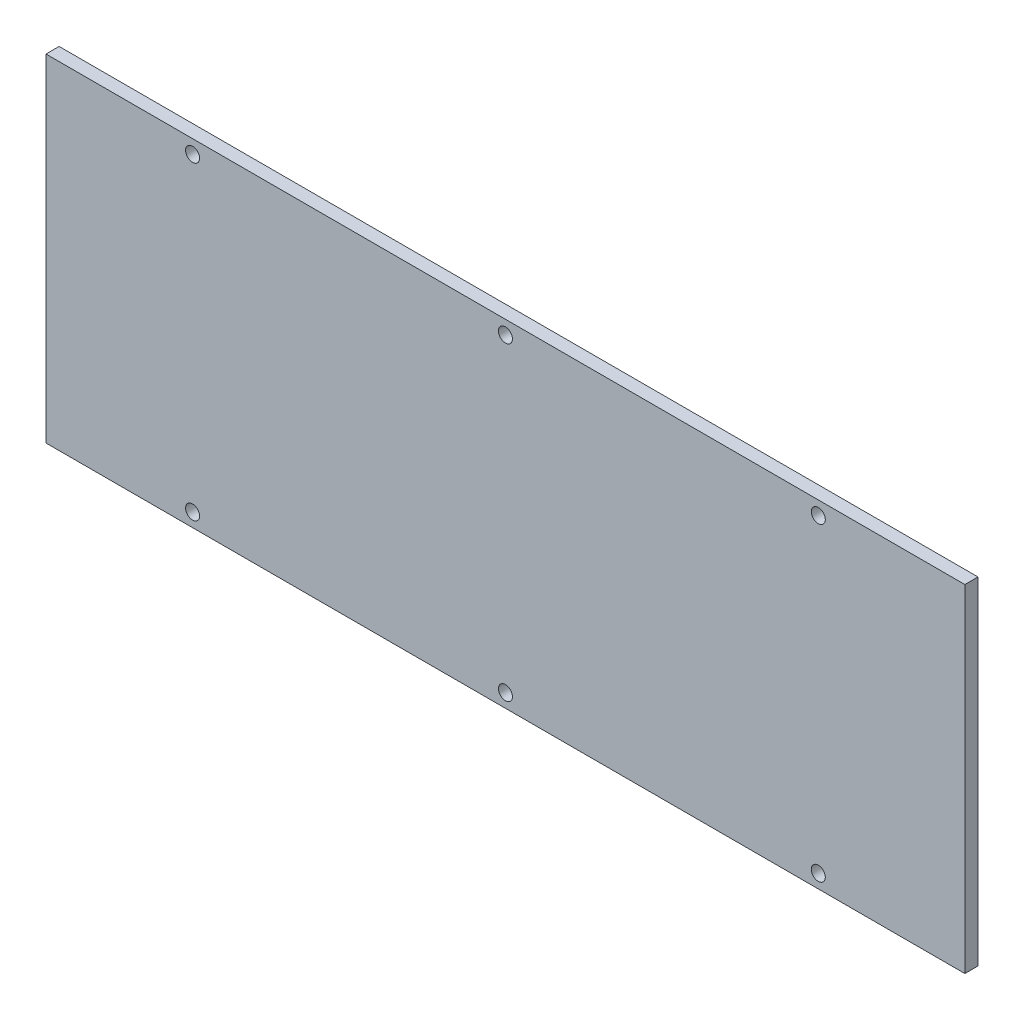
ISO-10303-21;
HEADER;
FILE_DESCRIPTION(('STEP AP214'),'2;1');
FILE_NAME('part.step','',(''),(''),'','','');
FILE_SCHEMA(('AUTOMOTIVE_DESIGN { 1 0 10303 214 1 1 1 1 }'));
ENDSEC;
DATA;
#1=APPLICATION_CONTEXT('core data for automotive mechanical design processes');
#2=APPLICATION_PROTOCOL_DEFINITION('international standard','automotive_design',2000,#1);
#3=PRODUCT_CONTEXT('',#1,'mechanical');
#4=PRODUCT('Part','Part','',(#3));
#5=PRODUCT_RELATED_PRODUCT_CATEGORY('part','',(#4));
#6=PRODUCT_DEFINITION_FORMATION('','',#4);
#7=PRODUCT_DEFINITION_CONTEXT('part definition',#1,'design');
#8=PRODUCT_DEFINITION('design','',#6,#7);
#9=PRODUCT_DEFINITION_SHAPE('','',#8);
#10=(LENGTH_UNIT() NAMED_UNIT(*) SI_UNIT(.MILLI.,.METRE.));
#11=(NAMED_UNIT(*) PLANE_ANGLE_UNIT() SI_UNIT($,.RADIAN.));
#12=(NAMED_UNIT(*) SI_UNIT($,.STERADIAN.) SOLID_ANGLE_UNIT());
#13=UNCERTAINTY_MEASURE_WITH_UNIT(LENGTH_MEASURE(1.E-05),#10,'distance_accuracy_value','');
#14=(GEOMETRIC_REPRESENTATION_CONTEXT(3) GLOBAL_UNCERTAINTY_ASSIGNED_CONTEXT((#13)) GLOBAL_UNIT_ASSIGNED_CONTEXT((#10,
#11,#12)) REPRESENTATION_CONTEXT('',''));
#15=CARTESIAN_POINT('',(0.,0.,0.));
#16=DIRECTION('',(0.,0.,1.));
#17=DIRECTION('',(1.,0.,0.));
#18=AXIS2_PLACEMENT_3D('',#15,#16,#17);
#19=CARTESIAN_POINT('',(-105.,38.5,3.));
#20=DIRECTION('',(0.,0.,1.));
#21=DIRECTION('',(1.,0.,0.));
#22=AXIS2_PLACEMENT_3D('',#19,#20,#21);
#23=PLANE('',#22);
#24=CARTESIAN_POINT('',(0.,-35.4,3.));
#25=DIRECTION('',(0.,0.,1.));
#26=DIRECTION('',(-1.,0.,0.));
#27=AXIS2_PLACEMENT_3D('',#24,#25,#26);
#28=CIRCLE('',#27,1.6);
#29=CARTESIAN_POINT('',(-1.6,-35.4,3.));
#30=VERTEX_POINT('',#29);
#31=EDGE_CURVE('E133',#30,#30,#28,.T.);
#32=ORIENTED_EDGE('',*,*,#31,.F.);
#33=EDGE_LOOP('',(#32));
#34=FACE_BOUND('',#33,.T.);
#35=CARTESIAN_POINT('',(71.5,35.4,3.));
#36=DIRECTION('',(0.,0.,1.));
#37=DIRECTION('',(1.,0.,0.));
#38=AXIS2_PLACEMENT_3D('',#35,#36,#37);
#39=CIRCLE('',#38,1.60000000000001);
#40=CARTESIAN_POINT('',(73.1,35.4,3.));
#41=VERTEX_POINT('',#40);
#42=EDGE_CURVE('E121',#41,#41,#39,.T.);
#43=ORIENTED_EDGE('',*,*,#42,.F.);
#44=EDGE_LOOP('',(#43));
#45=FACE_BOUND('',#44,.T.);
#46=CARTESIAN_POINT('',(0.,35.4,3.));
#47=DIRECTION('',(0.,0.,1.));
#48=DIRECTION('',(1.,0.,0.));
#49=AXIS2_PLACEMENT_3D('',#46,#47,#48);
#50=CIRCLE('',#49,1.6);
#51=CARTESIAN_POINT('',(1.6,35.4,3.));
#52=VERTEX_POINT('',#51);
#53=EDGE_CURVE('E100',#52,#52,#50,.T.);
#54=ORIENTED_EDGE('',*,*,#53,.F.);
#55=EDGE_LOOP('',(#54));
#56=FACE_BOUND('',#55,.T.);
#57=DIRECTION('',(0.,-1.,0.));
#58=VECTOR('',#57,1.);
#59=CARTESIAN_POINT('',(-105.,-38.5,3.));
#60=LINE('',#59,#58);
#61=CARTESIAN_POINT('',(-105.,38.5,3.));
#62=VERTEX_POINT('',#61);
#63=CARTESIAN_POINT('',(-105.,-38.5,3.));
#64=VERTEX_POINT('',#63);
#65=EDGE_CURVE('E85',#62,#64,#60,.T.);
#66=ORIENTED_EDGE('',*,*,#65,.T.);
#67=DIRECTION('',(1.,0.,0.));
#68=VECTOR('',#67,1.);
#69=CARTESIAN_POINT('',(105.,-38.5,3.));
#70=LINE('',#69,#68);
#71=CARTESIAN_POINT('',(105.,-38.5,3.));
#72=VERTEX_POINT('',#71);
#73=EDGE_CURVE('E80',#64,#72,#70,.T.);
#74=ORIENTED_EDGE('',*,*,#73,.T.);
#75=DIRECTION('',(0.,1.,0.));
#76=VECTOR('',#75,1.);
#77=CARTESIAN_POINT('',(105.,-38.5,3.));
#78=LINE('',#77,#76);
#79=CARTESIAN_POINT('',(105.,38.5,3.));
#80=VERTEX_POINT('',#79);
#81=EDGE_CURVE('E83',#72,#80,#78,.T.);
#82=ORIENTED_EDGE('',*,*,#81,.T.);
#83=DIRECTION('',(-1.,0.,0.));
#84=VECTOR('',#83,1.);
#85=CARTESIAN_POINT('',(105.,38.5,3.));
#86=LINE('',#85,#84);
#87=EDGE_CURVE('E50',#80,#62,#86,.T.);
#88=ORIENTED_EDGE('',*,*,#87,.T.);
#89=EDGE_LOOP('',(#66,#74,#82,#88));
#90=FACE_BOUND('',#89,.T.);
#91=CARTESIAN_POINT('',(-71.5,35.4,3.));
#92=DIRECTION('',(0.,0.,1.));
#93=DIRECTION('',(1.,0.,0.));
#94=AXIS2_PLACEMENT_3D('',#91,#92,#93);
#95=CIRCLE('',#94,1.60000000000001);
#96=CARTESIAN_POINT('',(-69.9,35.4,3.));
#97=VERTEX_POINT('',#96);
#98=EDGE_CURVE('E115',#97,#97,#95,.T.);
#99=ORIENTED_EDGE('',*,*,#98,.F.);
#100=EDGE_LOOP('',(#99));
#101=FACE_BOUND('',#100,.T.);
#102=CARTESIAN_POINT('',(71.5,-35.4,3.));
#103=DIRECTION('',(0.,0.,1.));
#104=DIRECTION('',(-1.,0.,0.));
#105=AXIS2_PLACEMENT_3D('',#102,#103,#104);
#106=CIRCLE('',#105,1.60000000000001);
#107=CARTESIAN_POINT('',(69.9,-35.4,3.));
#108=VERTEX_POINT('',#107);
#109=EDGE_CURVE('E127',#108,#108,#106,.T.);
#110=ORIENTED_EDGE('',*,*,#109,.F.);
#111=EDGE_LOOP('',(#110));
#112=FACE_BOUND('',#111,.T.);
#113=CARTESIAN_POINT('',(-71.5,-35.4,3.));
#114=DIRECTION('',(0.,0.,1.));
#115=DIRECTION('',(-1.,0.,0.));
#116=AXIS2_PLACEMENT_3D('',#113,#114,#115);
#117=CIRCLE('',#116,1.60000000000001);
#118=CARTESIAN_POINT('',(-73.1,-35.4,3.));
#119=VERTEX_POINT('',#118);
#120=EDGE_CURVE('E139',#119,#119,#117,.T.);
#121=ORIENTED_EDGE('',*,*,#120,.F.);
#122=EDGE_LOOP('',(#121));
#123=FACE_BOUND('',#122,.T.);
#124=ADVANCED_FACE('F33',(#34,#45,#56,#90,#101,#112,#123),#23,.T.);
#125=CARTESIAN_POINT('',(-105.,38.5,0.));
#126=DIRECTION('',(0.,0.,1.));
#127=DIRECTION('',(1.,0.,0.));
#128=AXIS2_PLACEMENT_3D('',#125,#126,#127);
#129=PLANE('',#128);
#130=CARTESIAN_POINT('',(0.,-35.4,0.));
#131=DIRECTION('',(0.,0.,1.));
#132=DIRECTION('',(-1.,0.,0.));
#133=AXIS2_PLACEMENT_3D('',#130,#131,#132);
#134=CIRCLE('',#133,1.6);
#135=CARTESIAN_POINT('',(-1.6,-35.4,0.));
#136=VERTEX_POINT('',#135);
#137=EDGE_CURVE('E136',#136,#136,#134,.T.);
#138=ORIENTED_EDGE('',*,*,#137,.T.);
#139=EDGE_LOOP('',(#138));
#140=FACE_BOUND('',#139,.T.);
#141=CARTESIAN_POINT('',(71.5,35.4,0.));
#142=DIRECTION('',(0.,0.,1.));
#143=DIRECTION('',(1.,0.,0.));
#144=AXIS2_PLACEMENT_3D('',#141,#142,#143);
#145=CIRCLE('',#144,1.60000000000001);
#146=CARTESIAN_POINT('',(73.1,35.4,0.));
#147=VERTEX_POINT('',#146);
#148=EDGE_CURVE('E124',#147,#147,#145,.T.);
#149=ORIENTED_EDGE('',*,*,#148,.T.);
#150=EDGE_LOOP('',(#149));
#151=FACE_BOUND('',#150,.T.);
#152=CARTESIAN_POINT('',(0.,35.4,0.));
#153=DIRECTION('',(0.,0.,1.));
#154=DIRECTION('',(1.,0.,0.));
#155=AXIS2_PLACEMENT_3D('',#152,#153,#154);
#156=CIRCLE('',#155,1.6);
#157=CARTESIAN_POINT('',(1.6,35.4,0.));
#158=VERTEX_POINT('',#157);
#159=EDGE_CURVE('E112',#158,#158,#156,.T.);
#160=ORIENTED_EDGE('',*,*,#159,.T.);
#161=EDGE_LOOP('',(#160));
#162=FACE_BOUND('',#161,.T.);
#163=DIRECTION('',(0.,-1.,0.));
#164=VECTOR('',#163,1.);
#165=CARTESIAN_POINT('',(-105.,-38.5,0.));
#166=LINE('',#165,#164);
#167=CARTESIAN_POINT('',(-105.,38.5,0.));
#168=VERTEX_POINT('',#167);
#169=CARTESIAN_POINT('',(-105.,-38.5,0.));
#170=VERTEX_POINT('',#169);
#171=EDGE_CURVE('E97',#168,#170,#166,.T.);
#172=ORIENTED_EDGE('',*,*,#171,.F.);
#173=DIRECTION('',(-1.,0.,0.));
#174=VECTOR('',#173,1.);
#175=CARTESIAN_POINT('',(105.,38.5,0.));
#176=LINE('',#175,#174);
#177=CARTESIAN_POINT('',(105.,38.5,0.));
#178=VERTEX_POINT('',#177);
#179=EDGE_CURVE('E73',#178,#168,#176,.T.);
#180=ORIENTED_EDGE('',*,*,#179,.F.);
#181=DIRECTION('',(0.,1.,0.));
#182=VECTOR('',#181,1.);
#183=CARTESIAN_POINT('',(105.,-38.5,0.));
#184=LINE('',#183,#182);
#185=CARTESIAN_POINT('',(105.,-38.5,0.));
#186=VERTEX_POINT('',#185);
#187=EDGE_CURVE('E67',#186,#178,#184,.T.);
#188=ORIENTED_EDGE('',*,*,#187,.F.);
#189=DIRECTION('',(1.,0.,0.));
#190=VECTOR('',#189,1.);
#191=CARTESIAN_POINT('',(105.,-38.5,0.));
#192=LINE('',#191,#190);
#193=EDGE_CURVE('E89',#170,#186,#192,.T.);
#194=ORIENTED_EDGE('',*,*,#193,.F.);
#195=EDGE_LOOP('',(#172,#180,#188,#194));
#196=FACE_BOUND('',#195,.T.);
#197=CARTESIAN_POINT('',(-71.5,35.4,0.));
#198=DIRECTION('',(0.,0.,1.));
#199=DIRECTION('',(1.,0.,0.));
#200=AXIS2_PLACEMENT_3D('',#197,#198,#199);
#201=CIRCLE('',#200,1.60000000000001);
#202=CARTESIAN_POINT('',(-69.9,35.4,0.));
#203=VERTEX_POINT('',#202);
#204=EDGE_CURVE('E118',#203,#203,#201,.T.);
#205=ORIENTED_EDGE('',*,*,#204,.T.);
#206=EDGE_LOOP('',(#205));
#207=FACE_BOUND('',#206,.T.);
#208=CARTESIAN_POINT('',(71.5,-35.4,0.));
#209=DIRECTION('',(0.,0.,1.));
#210=DIRECTION('',(-1.,0.,0.));
#211=AXIS2_PLACEMENT_3D('',#208,#209,#210);
#212=CIRCLE('',#211,1.60000000000001);
#213=CARTESIAN_POINT('',(69.9,-35.4,0.));
#214=VERTEX_POINT('',#213);
#215=EDGE_CURVE('E130',#214,#214,#212,.T.);
#216=ORIENTED_EDGE('',*,*,#215,.T.);
#217=EDGE_LOOP('',(#216));
#218=FACE_BOUND('',#217,.T.);
#219=CARTESIAN_POINT('',(-71.5,-35.4,0.));
#220=DIRECTION('',(0.,0.,1.));
#221=DIRECTION('',(-1.,0.,0.));
#222=AXIS2_PLACEMENT_3D('',#219,#220,#221);
#223=CIRCLE('',#222,1.60000000000001);
#224=CARTESIAN_POINT('',(-73.1,-35.4,0.));
#225=VERTEX_POINT('',#224);
#226=EDGE_CURVE('E142',#225,#225,#223,.T.);
#227=ORIENTED_EDGE('',*,*,#226,.T.);
#228=EDGE_LOOP('',(#227));
#229=FACE_BOUND('',#228,.T.);
#230=ADVANCED_FACE('F108',(#140,#151,#162,#196,#207,#218,#229),#129,.F.);
#231=CARTESIAN_POINT('',(-105.,-38.5,3.));
#232=DIRECTION('',(1.,0.,0.));
#233=DIRECTION('',(0.,0.,-1.));
#234=AXIS2_PLACEMENT_3D('',#231,#232,#233);
#235=PLANE('',#234);
#236=ORIENTED_EDGE('',*,*,#171,.T.);
#237=DIRECTION('',(0.,0.,-1.));
#238=VECTOR('',#237,1.);
#239=CARTESIAN_POINT('',(-105.,-38.5,3.));
#240=LINE('',#239,#238);
#241=EDGE_CURVE('E11',#64,#170,#240,.T.);
#242=ORIENTED_EDGE('',*,*,#241,.F.);
#243=ORIENTED_EDGE('',*,*,#65,.F.);
#244=DIRECTION('',(0.,0.,-1.));
#245=VECTOR('',#244,1.);
#246=CARTESIAN_POINT('',(-105.,38.5,3.));
#247=LINE('',#246,#245);
#248=EDGE_CURVE('E93',#62,#168,#247,.T.);
#249=ORIENTED_EDGE('',*,*,#248,.T.);
#250=EDGE_LOOP('',(#236,#242,#243,#249));
#251=FACE_BOUND('',#250,.T.);
#252=ADVANCED_FACE('F35',(#251),#235,.F.);
#253=CARTESIAN_POINT('',(105.,-38.5,3.));
#254=DIRECTION('',(0.,1.,0.));
#255=DIRECTION('',(-1.,0.,0.));
#256=AXIS2_PLACEMENT_3D('',#253,#254,#255);
#257=PLANE('',#256);
#258=ORIENTED_EDGE('',*,*,#193,.T.);
#259=DIRECTION('',(0.,0.,-1.));
#260=VECTOR('',#259,1.);
#261=CARTESIAN_POINT('',(105.,-38.5,3.));
#262=LINE('',#261,#260);
#263=EDGE_CURVE('E42',#72,#186,#262,.T.);
#264=ORIENTED_EDGE('',*,*,#263,.F.);
#265=ORIENTED_EDGE('',*,*,#73,.F.);
#266=ORIENTED_EDGE('',*,*,#241,.T.);
#267=EDGE_LOOP('',(#258,#264,#265,#266));
#268=FACE_BOUND('',#267,.T.);
#269=ADVANCED_FACE('F88',(#268),#257,.F.);
#270=CARTESIAN_POINT('',(105.,-38.5,3.));
#271=DIRECTION('',(-1.,0.,0.));
#272=DIRECTION('',(0.,0.,1.));
#273=AXIS2_PLACEMENT_3D('',#270,#271,#272);
#274=PLANE('',#273);
#275=ORIENTED_EDGE('',*,*,#187,.T.);
#276=DIRECTION('',(0.,0.,-1.));
#277=VECTOR('',#276,1.);
#278=CARTESIAN_POINT('',(105.,38.5,3.));
#279=LINE('',#278,#277);
#280=EDGE_CURVE('E90',#80,#178,#279,.T.);
#281=ORIENTED_EDGE('',*,*,#280,.F.);
#282=ORIENTED_EDGE('',*,*,#81,.F.);
#283=ORIENTED_EDGE('',*,*,#263,.T.);
#284=EDGE_LOOP('',(#275,#281,#282,#283));
#285=FACE_BOUND('',#284,.T.);
#286=ADVANCED_FACE('F91',(#285),#274,.F.);
#287=CARTESIAN_POINT('',(105.,38.5,3.));
#288=DIRECTION('',(0.,-1.,0.));
#289=DIRECTION('',(1.,0.,0.));
#290=AXIS2_PLACEMENT_3D('',#287,#288,#289);
#291=PLANE('',#290);
#292=ORIENTED_EDGE('',*,*,#179,.T.);
#293=ORIENTED_EDGE('',*,*,#248,.F.);
#294=ORIENTED_EDGE('',*,*,#87,.F.);
#295=ORIENTED_EDGE('',*,*,#280,.T.);
#296=EDGE_LOOP('',(#292,#293,#294,#295));
#297=FACE_BOUND('',#296,.T.);
#298=ADVANCED_FACE('F105',(#297),#291,.F.);
#299=CARTESIAN_POINT('',(0.,35.4,3.));
#300=DIRECTION('',(0.,0.,-1.));
#301=DIRECTION('',(-1.,0.,0.));
#302=AXIS2_PLACEMENT_3D('',#299,#300,#301);
#303=CYLINDRICAL_SURFACE('',#302,1.6);
#304=ORIENTED_EDGE('',*,*,#53,.T.);
#305=EDGE_LOOP('',(#304));
#306=FACE_BOUND('',#305,.T.);
#307=ORIENTED_EDGE('',*,*,#159,.F.);
#308=EDGE_LOOP('',(#307));
#309=FACE_BOUND('',#308,.T.);
#310=ADVANCED_FACE('F162',(#306,#309),#303,.F.);
#311=CARTESIAN_POINT('',(-71.5,35.4,3.));
#312=DIRECTION('',(0.,0.,-1.));
#313=DIRECTION('',(-1.,0.,0.));
#314=AXIS2_PLACEMENT_3D('',#311,#312,#313);
#315=CYLINDRICAL_SURFACE('',#314,1.60000000000001);
#316=ORIENTED_EDGE('',*,*,#98,.T.);
#317=EDGE_LOOP('',(#316));
#318=FACE_BOUND('',#317,.T.);
#319=ORIENTED_EDGE('',*,*,#204,.F.);
#320=EDGE_LOOP('',(#319));
#321=FACE_BOUND('',#320,.T.);
#322=ADVANCED_FACE('F208',(#318,#321),#315,.F.);
#323=CARTESIAN_POINT('',(71.5,35.4,3.));
#324=DIRECTION('',(0.,0.,-1.));
#325=DIRECTION('',(-1.,0.,0.));
#326=AXIS2_PLACEMENT_3D('',#323,#324,#325);
#327=CYLINDRICAL_SURFACE('',#326,1.60000000000001);
#328=ORIENTED_EDGE('',*,*,#42,.T.);
#329=EDGE_LOOP('',(#328));
#330=FACE_BOUND('',#329,.T.);
#331=ORIENTED_EDGE('',*,*,#148,.F.);
#332=EDGE_LOOP('',(#331));
#333=FACE_BOUND('',#332,.T.);
#334=ADVANCED_FACE('F216',(#330,#333),#327,.F.);
#335=CARTESIAN_POINT('',(71.5,-35.4,3.));
#336=DIRECTION('',(0.,0.,-1.));
#337=DIRECTION('',(-1.,0.,0.));
#338=AXIS2_PLACEMENT_3D('',#335,#336,#337);
#339=CYLINDRICAL_SURFACE('',#338,1.60000000000001);
#340=ORIENTED_EDGE('',*,*,#109,.T.);
#341=EDGE_LOOP('',(#340));
#342=FACE_BOUND('',#341,.T.);
#343=ORIENTED_EDGE('',*,*,#215,.F.);
#344=EDGE_LOOP('',(#343));
#345=FACE_BOUND('',#344,.T.);
#346=ADVANCED_FACE('F224',(#342,#345),#339,.F.);
#347=CARTESIAN_POINT('',(0.,-35.4,3.));
#348=DIRECTION('',(0.,0.,-1.));
#349=DIRECTION('',(-1.,0.,0.));
#350=AXIS2_PLACEMENT_3D('',#347,#348,#349);
#351=CYLINDRICAL_SURFACE('',#350,1.6);
#352=ORIENTED_EDGE('',*,*,#31,.T.);
#353=EDGE_LOOP('',(#352));
#354=FACE_BOUND('',#353,.T.);
#355=ORIENTED_EDGE('',*,*,#137,.F.);
#356=EDGE_LOOP('',(#355));
#357=FACE_BOUND('',#356,.T.);
#358=ADVANCED_FACE('F233',(#354,#357),#351,.F.);
#359=CARTESIAN_POINT('',(-71.5,-35.4,3.));
#360=DIRECTION('',(0.,0.,-1.));
#361=DIRECTION('',(-1.,0.,0.));
#362=AXIS2_PLACEMENT_3D('',#359,#360,#361);
#363=CYLINDRICAL_SURFACE('',#362,1.60000000000001);
#364=ORIENTED_EDGE('',*,*,#120,.T.);
#365=EDGE_LOOP('',(#364));
#366=FACE_BOUND('',#365,.T.);
#367=ORIENTED_EDGE('',*,*,#226,.F.);
#368=EDGE_LOOP('',(#367));
#369=FACE_BOUND('',#368,.T.);
#370=ADVANCED_FACE('F148',(#366,#369),#363,.F.);
#371=CLOSED_SHELL('',(#124,#230,#252,#269,#286,#298,#310,#322,#334,#346,#358,#370));
#372=MANIFOLD_SOLID_BREP('B2',#371);
#373=ADVANCED_BREP_SHAPE_REPRESENTATION('',(#18,#372),#14);
#374=SHAPE_DEFINITION_REPRESENTATION(#9,#373);
ENDSEC;
END-ISO-10303-21;
